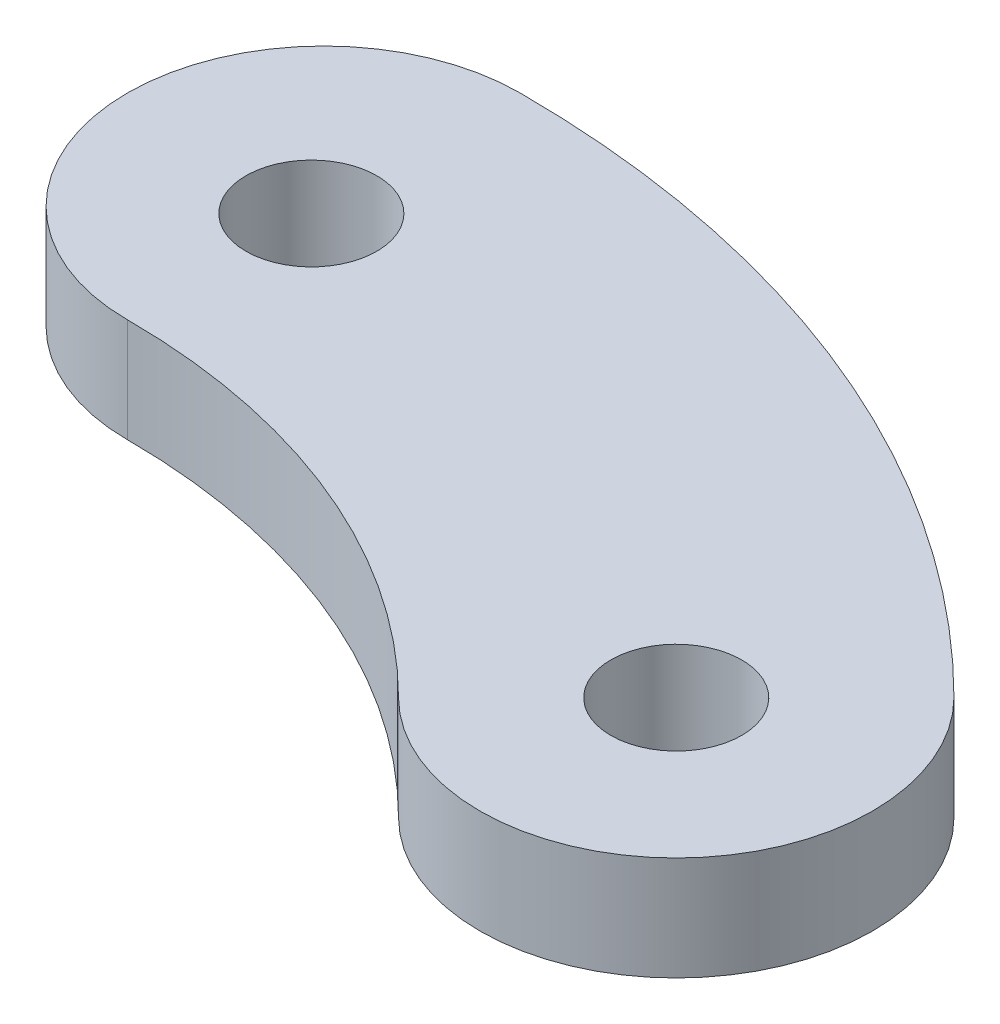
ISO-10303-21;
HEADER;
FILE_DESCRIPTION(('STEP AP214'),'2;1');
FILE_NAME('part.step','',(''),(''),'','','');
FILE_SCHEMA(('AUTOMOTIVE_DESIGN { 1 0 10303 214 1 1 1 1 }'));
ENDSEC;
DATA;
#1=APPLICATION_CONTEXT('core data for automotive mechanical design processes');
#2=APPLICATION_PROTOCOL_DEFINITION('international standard','automotive_design',2000,#1);
#3=PRODUCT_CONTEXT('',#1,'mechanical');
#4=PRODUCT('Part','Part','',(#3));
#5=PRODUCT_RELATED_PRODUCT_CATEGORY('part','',(#4));
#6=PRODUCT_DEFINITION_FORMATION('','',#4);
#7=PRODUCT_DEFINITION_CONTEXT('part definition',#1,'design');
#8=PRODUCT_DEFINITION('design','',#6,#7);
#9=PRODUCT_DEFINITION_SHAPE('','',#8);
#10=(LENGTH_UNIT() NAMED_UNIT(*) SI_UNIT(.MILLI.,.METRE.));
#11=(NAMED_UNIT(*) PLANE_ANGLE_UNIT() SI_UNIT($,.RADIAN.));
#12=(NAMED_UNIT(*) SI_UNIT($,.STERADIAN.) SOLID_ANGLE_UNIT());
#13=UNCERTAINTY_MEASURE_WITH_UNIT(LENGTH_MEASURE(1.E-05),#10,'distance_accuracy_value','');
#14=(GEOMETRIC_REPRESENTATION_CONTEXT(3) GLOBAL_UNCERTAINTY_ASSIGNED_CONTEXT((#13)) GLOBAL_UNIT_ASSIGNED_CONTEXT((#10,
#11,#12)) REPRESENTATION_CONTEXT('',''));
#15=CARTESIAN_POINT('',(0.,0.,0.));
#16=DIRECTION('',(0.,0.,1.));
#17=DIRECTION('',(1.,0.,0.));
#18=AXIS2_PLACEMENT_3D('',#15,#16,#17);
#19=CARTESIAN_POINT('',(22.9809703885627,7.9375,-22.9809703885629));
#20=DIRECTION('',(0.,1.,0.));
#21=DIRECTION('',(0.,0.,1.));
#22=AXIS2_PLACEMENT_3D('',#19,#20,#21);
#23=PLANE('',#22);
#24=CARTESIAN_POINT('',(0.,7.9375,-64.0537595198615));
#25=DIRECTION('',(0.,1.,0.));
#26=DIRECTION('',(0.,0.,1.));
#27=AXIS2_PLACEMENT_3D('',#24,#25,#26);
#28=CIRCLE('',#27,5.);
#29=CARTESIAN_POINT('',(0.,7.9375,-59.0537595198615));
#30=VERTEX_POINT('',#29);
#31=EDGE_CURVE('E100',#30,#30,#28,.T.);
#32=ORIENTED_EDGE('',*,*,#31,.F.);
#33=EDGE_LOOP('',(#32));
#34=FACE_BOUND('',#33,.T.);
#35=CARTESIAN_POINT('',(45.9619407771253,7.9375,-45.9619407771258));
#36=DIRECTION('',(0.,1.,0.));
#37=DIRECTION('',(0.,0.,1.));
#38=AXIS2_PLACEMENT_3D('',#35,#36,#37);
#39=CIRCLE('',#38,15.);
#40=CARTESIAN_POINT('',(35.3553390593272,7.9375,-35.3553390593276));
#41=VERTEX_POINT('',#40);
#42=CARTESIAN_POINT('',(56.5685424949235,7.9375,-56.5685424949241));
#43=VERTEX_POINT('',#42);
#44=EDGE_CURVE('E85',#41,#43,#39,.T.);
#45=ORIENTED_EDGE('',*,*,#44,.T.);
#46=CARTESIAN_POINT('',(0.,7.9375,0.));
#47=DIRECTION('',(0.,1.,0.));
#48=DIRECTION('',(0.,0.,1.));
#49=AXIS2_PLACEMENT_3D('',#46,#47,#48);
#50=CIRCLE('',#49,80.);
#51=CARTESIAN_POINT('',(0.,7.9375,-80.));
#52=VERTEX_POINT('',#51);
#53=EDGE_CURVE('E80',#43,#52,#50,.T.);
#54=ORIENTED_EDGE('',*,*,#53,.T.);
#55=CARTESIAN_POINT('',(0.,7.9375,-65.));
#56=DIRECTION('',(0.,1.,0.));
#57=DIRECTION('',(0.,0.,1.));
#58=AXIS2_PLACEMENT_3D('',#55,#56,#57);
#59=CIRCLE('',#58,15.);
#60=CARTESIAN_POINT('',(0.,7.9375,-50.));
#61=VERTEX_POINT('',#60);
#62=EDGE_CURVE('E83',#52,#61,#59,.T.);
#63=ORIENTED_EDGE('',*,*,#62,.T.);
#64=CARTESIAN_POINT('',(0.,7.9375,0.));
#65=DIRECTION('',(0.,-1.,0.));
#66=DIRECTION('',(0.,0.,1.));
#67=AXIS2_PLACEMENT_3D('',#64,#65,#66);
#68=CIRCLE('',#67,50.);
#69=EDGE_CURVE('E50',#61,#41,#68,.T.);
#70=ORIENTED_EDGE('',*,*,#69,.T.);
#71=EDGE_LOOP('',(#45,#54,#63,#70));
#72=FACE_BOUND('',#71,.T.);
#73=CARTESIAN_POINT('',(45.9619407771253,7.9375,-45.9619407771258));
#74=DIRECTION('',(0.,1.,0.));
#75=DIRECTION('',(0.,0.,1.));
#76=AXIS2_PLACEMENT_3D('',#73,#74,#75);
#77=CIRCLE('',#76,5.00000000000001);
#78=CARTESIAN_POINT('',(45.9619407771253,7.9375,-40.9619407771258));
#79=VERTEX_POINT('',#78);
#80=EDGE_CURVE('E115',#79,#79,#77,.T.);
#81=ORIENTED_EDGE('',*,*,#80,.F.);
#82=EDGE_LOOP('',(#81));
#83=FACE_BOUND('',#82,.T.);
#84=ADVANCED_FACE('F33',(#34,#72,#83),#23,.T.);
#85=CARTESIAN_POINT('',(22.9809703885627,0.,-22.9809703885629));
#86=DIRECTION('',(0.,1.,0.));
#87=DIRECTION('',(0.,0.,1.));
#88=AXIS2_PLACEMENT_3D('',#85,#86,#87);
#89=PLANE('',#88);
#90=CARTESIAN_POINT('',(45.9619407771253,0.,-45.9619407771258));
#91=DIRECTION('',(0.,1.,0.));
#92=DIRECTION('',(0.,0.,1.));
#93=AXIS2_PLACEMENT_3D('',#90,#91,#92);
#94=CIRCLE('',#93,15.);
#95=CARTESIAN_POINT('',(35.3553390593272,0.,-35.3553390593276));
#96=VERTEX_POINT('',#95);
#97=CARTESIAN_POINT('',(56.5685424949235,0.,-56.5685424949241));
#98=VERTEX_POINT('',#97);
#99=EDGE_CURVE('E97',#96,#98,#94,.T.);
#100=ORIENTED_EDGE('',*,*,#99,.F.);
#101=CARTESIAN_POINT('',(0.,0.,0.));
#102=DIRECTION('',(0.,-1.,0.));
#103=DIRECTION('',(0.,0.,1.));
#104=AXIS2_PLACEMENT_3D('',#101,#102,#103);
#105=CIRCLE('',#104,50.);
#106=CARTESIAN_POINT('',(0.,0.,-50.));
#107=VERTEX_POINT('',#106);
#108=EDGE_CURVE('E73',#107,#96,#105,.T.);
#109=ORIENTED_EDGE('',*,*,#108,.F.);
#110=CARTESIAN_POINT('',(0.,0.,-65.));
#111=DIRECTION('',(0.,1.,0.));
#112=DIRECTION('',(0.,0.,1.));
#113=AXIS2_PLACEMENT_3D('',#110,#111,#112);
#114=CIRCLE('',#113,15.);
#115=CARTESIAN_POINT('',(0.,0.,-80.));
#116=VERTEX_POINT('',#115);
#117=EDGE_CURVE('E67',#116,#107,#114,.T.);
#118=ORIENTED_EDGE('',*,*,#117,.F.);
#119=CARTESIAN_POINT('',(0.,0.,0.));
#120=DIRECTION('',(0.,1.,0.));
#121=DIRECTION('',(0.,0.,1.));
#122=AXIS2_PLACEMENT_3D('',#119,#120,#121);
#123=CIRCLE('',#122,80.);
#124=EDGE_CURVE('E89',#98,#116,#123,.T.);
#125=ORIENTED_EDGE('',*,*,#124,.F.);
#126=EDGE_LOOP('',(#100,#109,#118,#125));
#127=FACE_BOUND('',#126,.T.);
#128=CARTESIAN_POINT('',(0.,0.,-64.0537595198615));
#129=DIRECTION('',(0.,1.,0.));
#130=DIRECTION('',(0.,0.,1.));
#131=AXIS2_PLACEMENT_3D('',#128,#129,#130);
#132=CIRCLE('',#131,5.);
#133=CARTESIAN_POINT('',(0.,0.,-59.0537595198615));
#134=VERTEX_POINT('',#133);
#135=EDGE_CURVE('E112',#134,#134,#132,.T.);
#136=ORIENTED_EDGE('',*,*,#135,.T.);
#137=EDGE_LOOP('',(#136));
#138=FACE_BOUND('',#137,.T.);
#139=CARTESIAN_POINT('',(45.9619407771253,0.,-45.9619407771258));
#140=DIRECTION('',(0.,1.,0.));
#141=DIRECTION('',(0.,0.,1.));
#142=AXIS2_PLACEMENT_3D('',#139,#140,#141);
#143=CIRCLE('',#142,5.00000000000001);
#144=CARTESIAN_POINT('',(45.9619407771253,0.,-40.9619407771258));
#145=VERTEX_POINT('',#144);
#146=EDGE_CURVE('E118',#145,#145,#143,.T.);
#147=ORIENTED_EDGE('',*,*,#146,.T.);
#148=EDGE_LOOP('',(#147));
#149=FACE_BOUND('',#148,.T.);
#150=ADVANCED_FACE('F108',(#127,#138,#149),#89,.F.);
#151=CARTESIAN_POINT('',(45.9619407771253,7.9375,-45.9619407771258));
#152=DIRECTION('',(0.,-1.,0.));
#153=DIRECTION('',(0.,0.,-1.));
#154=AXIS2_PLACEMENT_3D('',#151,#152,#153);
#155=CYLINDRICAL_SURFACE('',#154,15.);
#156=ORIENTED_EDGE('',*,*,#99,.T.);
#157=DIRECTION('',(0.,-1.,0.));
#158=VECTOR('',#157,1.);
#159=CARTESIAN_POINT('',(56.5685424949235,7.9375,-56.5685424949241));
#160=LINE('',#159,#158);
#161=EDGE_CURVE('E11',#43,#98,#160,.T.);
#162=ORIENTED_EDGE('',*,*,#161,.F.);
#163=ORIENTED_EDGE('',*,*,#44,.F.);
#164=DIRECTION('',(0.,-1.,0.));
#165=VECTOR('',#164,1.);
#166=CARTESIAN_POINT('',(35.3553390593272,7.9375,-35.3553390593276));
#167=LINE('',#166,#165);
#168=EDGE_CURVE('E93',#41,#96,#167,.T.);
#169=ORIENTED_EDGE('',*,*,#168,.T.);
#170=EDGE_LOOP('',(#156,#162,#163,#169));
#171=FACE_BOUND('',#170,.T.);
#172=ADVANCED_FACE('F35',(#171),#155,.T.);
#173=CARTESIAN_POINT('',(0.,7.9375,0.));
#174=DIRECTION('',(0.,-1.,0.));
#175=DIRECTION('',(0.,0.,-1.));
#176=AXIS2_PLACEMENT_3D('',#173,#174,#175);
#177=CYLINDRICAL_SURFACE('',#176,80.);
#178=ORIENTED_EDGE('',*,*,#124,.T.);
#179=DIRECTION('',(0.,-1.,0.));
#180=VECTOR('',#179,1.);
#181=CARTESIAN_POINT('',(0.,7.9375,-80.));
#182=LINE('',#181,#180);
#183=EDGE_CURVE('E42',#52,#116,#182,.T.);
#184=ORIENTED_EDGE('',*,*,#183,.F.);
#185=ORIENTED_EDGE('',*,*,#53,.F.);
#186=ORIENTED_EDGE('',*,*,#161,.T.);
#187=EDGE_LOOP('',(#178,#184,#185,#186));
#188=FACE_BOUND('',#187,.T.);
#189=ADVANCED_FACE('F88',(#188),#177,.T.);
#190=CARTESIAN_POINT('',(0.,7.9375,-65.));
#191=DIRECTION('',(0.,-1.,0.));
#192=DIRECTION('',(0.,0.,-1.));
#193=AXIS2_PLACEMENT_3D('',#190,#191,#192);
#194=CYLINDRICAL_SURFACE('',#193,15.);
#195=ORIENTED_EDGE('',*,*,#117,.T.);
#196=DIRECTION('',(0.,-1.,0.));
#197=VECTOR('',#196,1.);
#198=CARTESIAN_POINT('',(0.,7.9375,-50.));
#199=LINE('',#198,#197);
#200=EDGE_CURVE('E90',#61,#107,#199,.T.);
#201=ORIENTED_EDGE('',*,*,#200,.F.);
#202=ORIENTED_EDGE('',*,*,#62,.F.);
#203=ORIENTED_EDGE('',*,*,#183,.T.);
#204=EDGE_LOOP('',(#195,#201,#202,#203));
#205=FACE_BOUND('',#204,.T.);
#206=ADVANCED_FACE('F91',(#205),#194,.T.);
#207=CARTESIAN_POINT('',(0.,7.9375,0.));
#208=DIRECTION('',(0.,-1.,0.));
#209=DIRECTION('',(0.,0.,-1.));
#210=AXIS2_PLACEMENT_3D('',#207,#208,#209);
#211=CYLINDRICAL_SURFACE('',#210,50.);
#212=ORIENTED_EDGE('',*,*,#108,.T.);
#213=ORIENTED_EDGE('',*,*,#168,.F.);
#214=ORIENTED_EDGE('',*,*,#69,.F.);
#215=ORIENTED_EDGE('',*,*,#200,.T.);
#216=EDGE_LOOP('',(#212,#213,#214,#215));
#217=FACE_BOUND('',#216,.T.);
#218=ADVANCED_FACE('F105',(#217),#211,.F.);
#219=CARTESIAN_POINT('',(0.,7.9375,-64.0537595198615));
#220=DIRECTION('',(0.,-1.,0.));
#221=DIRECTION('',(0.,0.,-1.));
#222=AXIS2_PLACEMENT_3D('',#219,#220,#221);
#223=CYLINDRICAL_SURFACE('',#222,5.);
#224=ORIENTED_EDGE('',*,*,#31,.T.);
#225=EDGE_LOOP('',(#224));
#226=FACE_BOUND('',#225,.T.);
#227=ORIENTED_EDGE('',*,*,#135,.F.);
#228=EDGE_LOOP('',(#227));
#229=FACE_BOUND('',#228,.T.);
#230=ADVANCED_FACE('F135',(#226,#229),#223,.F.);
#231=CARTESIAN_POINT('',(45.9619407771253,7.9375,-45.9619407771258));
#232=DIRECTION('',(0.,-1.,0.));
#233=DIRECTION('',(0.,0.,-1.));
#234=AXIS2_PLACEMENT_3D('',#231,#232,#233);
#235=CYLINDRICAL_SURFACE('',#234,5.00000000000001);
#236=ORIENTED_EDGE('',*,*,#80,.T.);
#237=EDGE_LOOP('',(#236));
#238=FACE_BOUND('',#237,.T.);
#239=ORIENTED_EDGE('',*,*,#146,.F.);
#240=EDGE_LOOP('',(#239));
#241=FACE_BOUND('',#240,.T.);
#242=ADVANCED_FACE('F124',(#238,#241),#235,.F.);
#243=CLOSED_SHELL('',(#84,#150,#172,#189,#206,#218,#230,#242));
#244=MANIFOLD_SOLID_BREP('B2',#243);
#245=ADVANCED_BREP_SHAPE_REPRESENTATION('',(#18,#244),#14);
#246=SHAPE_DEFINITION_REPRESENTATION(#9,#245);
ENDSEC;
END-ISO-10303-21;
